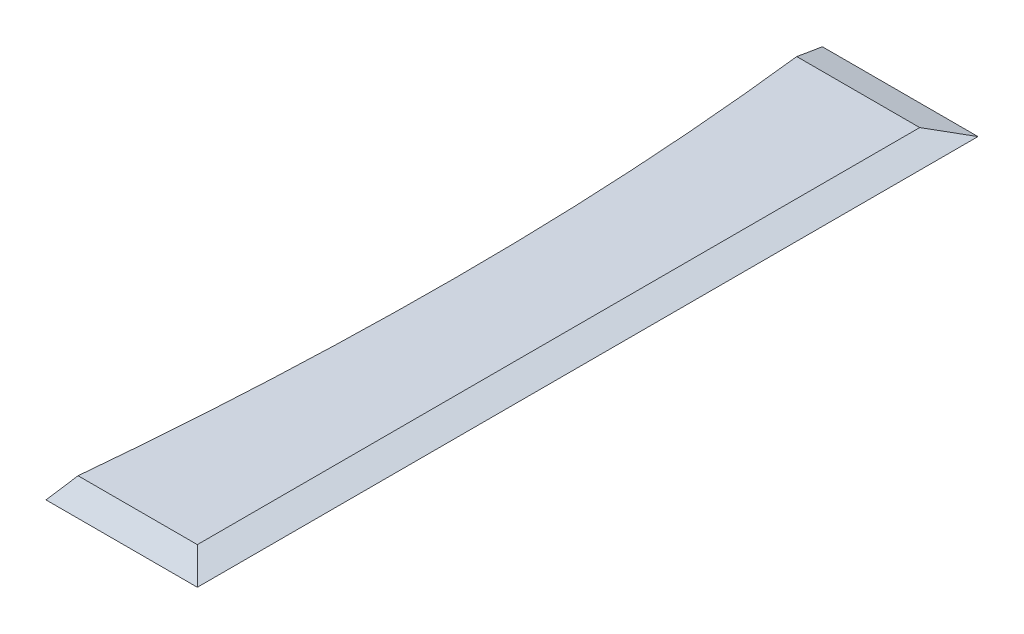
ISO-10303-21;
HEADER;
FILE_DESCRIPTION(('STEP AP214'),'2;1');
FILE_NAME('part.step','',(''),(''),'','','');
FILE_SCHEMA(('AUTOMOTIVE_DESIGN { 1 0 10303 214 1 1 1 1 }'));
ENDSEC;
DATA;
#1=APPLICATION_CONTEXT('core data for automotive mechanical design processes');
#2=APPLICATION_PROTOCOL_DEFINITION('international standard','automotive_design',2000,#1);
#3=PRODUCT_CONTEXT('',#1,'mechanical');
#4=PRODUCT('Part','Part','',(#3));
#5=PRODUCT_RELATED_PRODUCT_CATEGORY('part','',(#4));
#6=PRODUCT_DEFINITION_FORMATION('','',#4);
#7=PRODUCT_DEFINITION_CONTEXT('part definition',#1,'design');
#8=PRODUCT_DEFINITION('design','',#6,#7);
#9=PRODUCT_DEFINITION_SHAPE('','',#8);
#10=(LENGTH_UNIT() NAMED_UNIT(*) SI_UNIT(.MILLI.,.METRE.));
#11=(NAMED_UNIT(*) PLANE_ANGLE_UNIT() SI_UNIT($,.RADIAN.));
#12=(NAMED_UNIT(*) SI_UNIT($,.STERADIAN.) SOLID_ANGLE_UNIT());
#13=UNCERTAINTY_MEASURE_WITH_UNIT(LENGTH_MEASURE(1.E-05),#10,'distance_accuracy_value','');
#14=(GEOMETRIC_REPRESENTATION_CONTEXT(3) GLOBAL_UNCERTAINTY_ASSIGNED_CONTEXT((#13)) GLOBAL_UNIT_ASSIGNED_CONTEXT((#10,
#11,#12)) REPRESENTATION_CONTEXT('',''));
#15=CARTESIAN_POINT('',(0.,0.,0.));
#16=DIRECTION('',(0.,0.,1.));
#17=DIRECTION('',(1.,0.,0.));
#18=AXIS2_PLACEMENT_3D('',#15,#16,#17);
#19=CARTESIAN_POINT('',(-1042.,2.5,1.53320715498562E-13));
#20=DIRECTION('',(0.,-1.,0.));
#21=DIRECTION('',(0.,0.,-1.));
#22=AXIS2_PLACEMENT_3D('',#19,#20,#21);
#23=CYLINDRICAL_SURFACE('',#22,1000.);
#24=CARTESIAN_POINT('',(-1042.,33.4936490538905,1.53320715498562E-13));
#25=DIRECTION('',(0.,0.965925826289068,-0.258819045102521));
#26=DIRECTION('',(0.,-0.258819045102521,-0.965925826289068));
#27=AXIS2_PLACEMENT_3D('',#24,#25,#26);
#28=ELLIPSE('',#27,1035.27618041008,1000.);
#29=CARTESIAN_POINT('',(-48.7122871571695,2.5,-115.669872981078));
#30=VERTEX_POINT('',#29);
#31=CARTESIAN_POINT('',(-49.8432583507786,0.,-125.));
#32=VERTEX_POINT('',#31);
#33=EDGE_CURVE('E136',#30,#32,#28,.T.);
#34=ORIENTED_EDGE('',*,*,#33,.T.);
#35=CARTESIAN_POINT('',(-1042.,-33.4936490538905,1.53320715498562E-13));
#36=DIRECTION('',(0.,0.965925826289068,0.258819045102521));
#37=DIRECTION('',(0.,-0.258819045102521,0.965925826289068));
#38=AXIS2_PLACEMENT_3D('',#35,#36,#37);
#39=ELLIPSE('',#38,1035.27618041008,1000.);
#40=CARTESIAN_POINT('',(-48.7122871571694,-2.5,-115.669872981078));
#41=VERTEX_POINT('',#40);
#42=EDGE_CURVE('E116',#32,#41,#39,.F.);
#43=ORIENTED_EDGE('',*,*,#42,.T.);
#44=CARTESIAN_POINT('',(-1042.,-2.5,1.53320715498562E-13));
#45=DIRECTION('',(0.,-1.,0.));
#46=DIRECTION('',(0.,0.,1.));
#47=AXIS2_PLACEMENT_3D('',#44,#45,#46);
#48=CIRCLE('',#47,1000.);
#49=CARTESIAN_POINT('',(-42.,-2.5,0.));
#50=VERTEX_POINT('',#49);
#51=EDGE_CURVE('E124',#41,#50,#48,.T.);
#52=ORIENTED_EDGE('',*,*,#51,.T.);
#53=DIRECTION('',(0.,-1.,0.));
#54=VECTOR('',#53,1.);
#55=CARTESIAN_POINT('',(-42.,2.5,0.));
#56=LINE('',#55,#54);
#57=CARTESIAN_POINT('',(-42.,2.5,0.));
#58=VERTEX_POINT('',#57);
#59=EDGE_CURVE('E133',#58,#50,#56,.T.);
#60=ORIENTED_EDGE('',*,*,#59,.F.);
#61=CARTESIAN_POINT('',(-1042.,2.5,1.53320715498562E-13));
#62=DIRECTION('',(0.,-1.,0.));
#63=DIRECTION('',(0.,0.,1.));
#64=AXIS2_PLACEMENT_3D('',#61,#62,#63);
#65=CIRCLE('',#64,1000.);
#66=EDGE_CURVE('E129',#30,#58,#65,.T.);
#67=ORIENTED_EDGE('',*,*,#66,.F.);
#68=EDGE_LOOP('',(#34,#43,#52,#60,#67));
#69=FACE_BOUND('',#68,.T.);
#70=ADVANCED_FACE('F31',(#69),#23,.F.);
#71=CARTESIAN_POINT('',(-1252.,2.5,1.53320715498562E-13));
#72=DIRECTION('',(0.,-1.,0.));
#73=DIRECTION('',(0.,0.,-1.));
#74=AXIS2_PLACEMENT_3D('',#71,#72,#73);
#75=CYLINDRICAL_SURFACE('',#74,1210.);
#76=CARTESIAN_POINT('',(-1252.,-2.5,1.53320715498562E-13));
#77=DIRECTION('',(0.,-1.,0.));
#78=DIRECTION('',(0.,0.,-1.));
#79=AXIS2_PLACEMENT_3D('',#76,#77,#78);
#80=CIRCLE('',#79,1210.);
#81=CARTESIAN_POINT('',(-47.5414160360095,-2.5,115.669872981078));
#82=VERTEX_POINT('',#81);
#83=EDGE_CURVE('E126',#50,#82,#80,.T.);
#84=ORIENTED_EDGE('',*,*,#83,.T.);
#85=CARTESIAN_POINT('',(-1252.,-33.4936490538904,1.53320715498562E-13));
#86=DIRECTION('',(0.,0.965925826289068,-0.258819045102521));
#87=DIRECTION('',(0.,-0.258819045102521,-0.965925826289068));
#88=AXIS2_PLACEMENT_3D('',#85,#86,#87);
#89=ELLIPSE('',#88,1252.6841782962,1210.);
#90=CARTESIAN_POINT('',(-48.4739304859243,0.,125.));
#91=VERTEX_POINT('',#90);
#92=EDGE_CURVE('E146',#82,#91,#89,.F.);
#93=ORIENTED_EDGE('',*,*,#92,.T.);
#94=CARTESIAN_POINT('',(-1252.,33.4936490538904,1.53320715498562E-13));
#95=DIRECTION('',(0.,0.965925826289068,0.258819045102521));
#96=DIRECTION('',(0.,-0.258819045102521,0.965925826289068));
#97=AXIS2_PLACEMENT_3D('',#94,#95,#96);
#98=ELLIPSE('',#97,1252.6841782962,1210.);
#99=CARTESIAN_POINT('',(-47.5414160360095,2.5,115.669872981078));
#100=VERTEX_POINT('',#99);
#101=EDGE_CURVE('E144',#91,#100,#98,.T.);
#102=ORIENTED_EDGE('',*,*,#101,.T.);
#103=CARTESIAN_POINT('',(-1252.,2.5,1.53320715498562E-13));
#104=DIRECTION('',(0.,-1.,0.));
#105=DIRECTION('',(0.,0.,-1.));
#106=AXIS2_PLACEMENT_3D('',#103,#104,#105);
#107=CIRCLE('',#106,1210.);
#108=EDGE_CURVE('E131',#58,#100,#107,.T.);
#109=ORIENTED_EDGE('',*,*,#108,.F.);
#110=ORIENTED_EDGE('',*,*,#59,.T.);
#111=EDGE_LOOP('',(#84,#93,#102,#109,#110));
#112=FACE_BOUND('',#111,.T.);
#113=ADVANCED_FACE('F151',(#112),#75,.F.);
#114=CARTESIAN_POINT('',(-1042.,2.5,1.53320715498562E-13));
#115=DIRECTION('',(0.,1.,0.));
#116=DIRECTION('',(0.,0.,1.));
#117=AXIS2_PLACEMENT_3D('',#114,#115,#116);
#118=PLANE('',#117);
#119=DIRECTION('',(0.,0.,-1.));
#120=VECTOR('',#119,1.);
#121=CARTESIAN_POINT('',(-9.33012701892211,2.5,-125.));
#122=LINE('',#121,#120);
#123=CARTESIAN_POINT('',(-9.33012701892211,2.5,115.669872981078));
#124=VERTEX_POINT('',#123);
#125=CARTESIAN_POINT('',(-9.33012701892211,2.5,-115.669872981078));
#126=VERTEX_POINT('',#125);
#127=EDGE_CURVE('E44',#124,#126,#122,.T.);
#128=ORIENTED_EDGE('',*,*,#127,.T.);
#129=DIRECTION('',(-1.,0.,0.));
#130=VECTOR('',#129,1.);
#131=CARTESIAN_POINT('',(-49.8432583507786,2.5,-115.669872981078));
#132=LINE('',#131,#130);
#133=EDGE_CURVE('E11',#126,#30,#132,.T.);
#134=ORIENTED_EDGE('',*,*,#133,.T.);
#135=ORIENTED_EDGE('',*,*,#66,.T.);
#136=ORIENTED_EDGE('',*,*,#108,.T.);
#137=DIRECTION('',(1.,0.,0.));
#138=VECTOR('',#137,1.);
#139=CARTESIAN_POINT('',(0.,2.5,115.669872981078));
#140=LINE('',#139,#138);
#141=EDGE_CURVE('E38',#100,#124,#140,.T.);
#142=ORIENTED_EDGE('',*,*,#141,.T.);
#143=EDGE_LOOP('',(#128,#134,#135,#136,#142));
#144=FACE_BOUND('',#143,.T.);
#145=ADVANCED_FACE('F165',(#144),#118,.T.);
#146=CARTESIAN_POINT('',(-1042.,-2.5,1.53320715498562E-13));
#147=DIRECTION('',(0.,1.,0.));
#148=DIRECTION('',(0.,0.,1.));
#149=AXIS2_PLACEMENT_3D('',#146,#147,#148);
#150=PLANE('',#149);
#151=ORIENTED_EDGE('',*,*,#51,.F.);
#152=DIRECTION('',(1.,0.,0.));
#153=VECTOR('',#152,1.);
#154=CARTESIAN_POINT('',(-1042.,-2.5,-115.669872981078));
#155=LINE('',#154,#153);
#156=CARTESIAN_POINT('',(-9.33012701892211,-2.5,-115.669872981078));
#157=VERTEX_POINT('',#156);
#158=EDGE_CURVE('E142',#41,#157,#155,.T.);
#159=ORIENTED_EDGE('',*,*,#158,.T.);
#160=DIRECTION('',(0.,0.,1.));
#161=VECTOR('',#160,1.);
#162=CARTESIAN_POINT('',(-9.33012701892211,-2.5,1.53320715498562E-13));
#163=LINE('',#162,#161);
#164=CARTESIAN_POINT('',(-9.33012701892211,-2.5,115.669872981078));
#165=VERTEX_POINT('',#164);
#166=EDGE_CURVE('E110',#157,#165,#163,.T.);
#167=ORIENTED_EDGE('',*,*,#166,.T.);
#168=DIRECTION('',(-1.,0.,0.));
#169=VECTOR('',#168,1.);
#170=CARTESIAN_POINT('',(-1042.,-2.5,115.669872981078));
#171=LINE('',#170,#169);
#172=EDGE_CURVE('E140',#165,#82,#171,.T.);
#173=ORIENTED_EDGE('',*,*,#172,.T.);
#174=ORIENTED_EDGE('',*,*,#83,.F.);
#175=EDGE_LOOP('',(#151,#159,#167,#173,#174));
#176=FACE_BOUND('',#175,.T.);
#177=ADVANCED_FACE('F161',(#176),#150,.F.);
#178=CARTESIAN_POINT('',(-1042.,2.5,115.669872981078));
#179=DIRECTION('',(0.,0.965925826289068,0.258819045102521));
#180=DIRECTION('',(0.,-0.258819045102521,0.965925826289068));
#181=AXIS2_PLACEMENT_3D('',#178,#179,#180);
#182=PLANE('',#181);
#183=ORIENTED_EDGE('',*,*,#141,.F.);
#184=ORIENTED_EDGE('',*,*,#101,.F.);
#185=DIRECTION('',(-1.,0.,0.));
#186=VECTOR('',#185,1.);
#187=CARTESIAN_POINT('',(-48.4739304859243,0.,125.));
#188=LINE('',#187,#186);
#189=CARTESIAN_POINT('',(0.,0.,125.));
#190=VERTEX_POINT('',#189);
#191=EDGE_CURVE('E121',#190,#91,#188,.T.);
#192=ORIENTED_EDGE('',*,*,#191,.F.);
#193=DIRECTION('',(0.694746590606864,-0.186156787897386,0.694746590606868));
#194=VECTOR('',#193,1.);
#195=CARTESIAN_POINT('',(-65.1608313965814,17.4597921508547,59.8391686034182));
#196=LINE('',#195,#194);
#197=EDGE_CURVE('E92',#124,#190,#196,.T.);
#198=ORIENTED_EDGE('',*,*,#197,.F.);
#199=EDGE_LOOP('',(#183,#184,#192,#198));
#200=FACE_BOUND('',#199,.T.);
#201=ADVANCED_FACE('F157',(#200),#182,.T.);
#202=CARTESIAN_POINT('',(-48.4739304859243,0.,125.));
#203=DIRECTION('',(0.,0.965925826289068,-0.258819045102521));
#204=DIRECTION('',(0.,0.258819045102521,0.965925826289068));
#205=AXIS2_PLACEMENT_3D('',#202,#203,#204);
#206=PLANE('',#205);
#207=ORIENTED_EDGE('',*,*,#92,.F.);
#208=ORIENTED_EDGE('',*,*,#172,.F.);
#209=DIRECTION('',(-0.694746590606864,-0.186156787897386,-0.694746590606868));
#210=VECTOR('',#209,1.);
#211=CARTESIAN_POINT('',(-120.668206289966,-32.3329484275088,4.33179371003339));
#212=LINE('',#211,#210);
#213=EDGE_CURVE('E97',#190,#165,#212,.T.);
#214=ORIENTED_EDGE('',*,*,#213,.F.);
#215=ORIENTED_EDGE('',*,*,#191,.T.);
#216=EDGE_LOOP('',(#207,#208,#214,#215));
#217=FACE_BOUND('',#216,.T.);
#218=ADVANCED_FACE('F158',(#217),#206,.F.);
#219=CARTESIAN_POINT('',(-9.33012701892211,2.5,1.53320715498562E-13));
#220=DIRECTION('',(0.258819045102523,0.965925826289068,0.));
#221=DIRECTION('',(-0.965925826289068,0.258819045102523,0.));
#222=AXIS2_PLACEMENT_3D('',#219,#220,#221);
#223=PLANE('',#222);
#224=ORIENTED_EDGE('',*,*,#127,.F.);
#225=ORIENTED_EDGE('',*,*,#197,.T.);
#226=DIRECTION('',(0.,0.,1.));
#227=VECTOR('',#226,1.);
#228=CARTESIAN_POINT('',(0.,0.,125.));
#229=LINE('',#228,#227);
#230=CARTESIAN_POINT('',(0.,0.,-125.));
#231=VERTEX_POINT('',#230);
#232=EDGE_CURVE('E87',#231,#190,#229,.T.);
#233=ORIENTED_EDGE('',*,*,#232,.F.);
#234=DIRECTION('',(-0.694746590606864,0.186156787897386,0.694746590606868));
#235=VECTOR('',#234,1.);
#236=CARTESIAN_POINT('',(-65.1608313965816,17.4597921508547,-59.839168603418));
#237=LINE('',#236,#235);
#238=EDGE_CURVE('E90',#126,#231,#237,.F.);
#239=ORIENTED_EDGE('',*,*,#238,.F.);
#240=EDGE_LOOP('',(#224,#225,#233,#239));
#241=FACE_BOUND('',#240,.T.);
#242=ADVANCED_FACE('F89',(#241),#223,.T.);
#243=CARTESIAN_POINT('',(0.,0.,-125.));
#244=DIRECTION('',(-0.258819045102523,0.965925826289068,0.));
#245=DIRECTION('',(-0.965925826289068,-0.258819045102523,0.));
#246=AXIS2_PLACEMENT_3D('',#243,#244,#245);
#247=PLANE('',#246);
#248=ORIENTED_EDGE('',*,*,#213,.T.);
#249=ORIENTED_EDGE('',*,*,#166,.F.);
#250=DIRECTION('',(0.694746590606864,0.186156787897386,-0.694746590606868));
#251=VECTOR('',#250,1.);
#252=CARTESIAN_POINT('',(0.,0.,-125.));
#253=LINE('',#252,#251);
#254=EDGE_CURVE('E106',#231,#157,#253,.F.);
#255=ORIENTED_EDGE('',*,*,#254,.F.);
#256=ORIENTED_EDGE('',*,*,#232,.T.);
#257=EDGE_LOOP('',(#248,#249,#255,#256));
#258=FACE_BOUND('',#257,.T.);
#259=ADVANCED_FACE('F109',(#258),#247,.F.);
#260=CARTESIAN_POINT('',(-1042.,2.5,-115.669872981078));
#261=DIRECTION('',(0.,0.965925826289068,-0.258819045102521));
#262=DIRECTION('',(0.,0.258819045102521,0.965925826289068));
#263=AXIS2_PLACEMENT_3D('',#260,#261,#262);
#264=PLANE('',#263);
#265=ORIENTED_EDGE('',*,*,#133,.F.);
#266=ORIENTED_EDGE('',*,*,#238,.T.);
#267=DIRECTION('',(1.,0.,0.));
#268=VECTOR('',#267,1.);
#269=CARTESIAN_POINT('',(0.,0.,-125.));
#270=LINE('',#269,#268);
#271=EDGE_CURVE('E104',#32,#231,#270,.T.);
#272=ORIENTED_EDGE('',*,*,#271,.F.);
#273=ORIENTED_EDGE('',*,*,#33,.F.);
#274=EDGE_LOOP('',(#265,#266,#272,#273));
#275=FACE_BOUND('',#274,.T.);
#276=ADVANCED_FACE('F101',(#275),#264,.T.);
#277=CARTESIAN_POINT('',(-49.8432583507786,0.,-125.));
#278=DIRECTION('',(0.,0.965925826289068,0.258819045102521));
#279=DIRECTION('',(0.,-0.258819045102521,0.965925826289068));
#280=AXIS2_PLACEMENT_3D('',#277,#278,#279);
#281=PLANE('',#280);
#282=ORIENTED_EDGE('',*,*,#254,.T.);
#283=ORIENTED_EDGE('',*,*,#158,.F.);
#284=ORIENTED_EDGE('',*,*,#42,.F.);
#285=ORIENTED_EDGE('',*,*,#271,.T.);
#286=EDGE_LOOP('',(#282,#283,#284,#285));
#287=FACE_BOUND('',#286,.T.);
#288=ADVANCED_FACE('F115',(#287),#281,.F.);
#289=CLOSED_SHELL('',(#70,#113,#145,#177,#201,#218,#242,#259,#276,#288));
#290=MANIFOLD_SOLID_BREP('B2',#289);
#291=ADVANCED_BREP_SHAPE_REPRESENTATION('',(#18,#290),#14);
#292=SHAPE_DEFINITION_REPRESENTATION(#9,#291);
ENDSEC;
END-ISO-10303-21;
